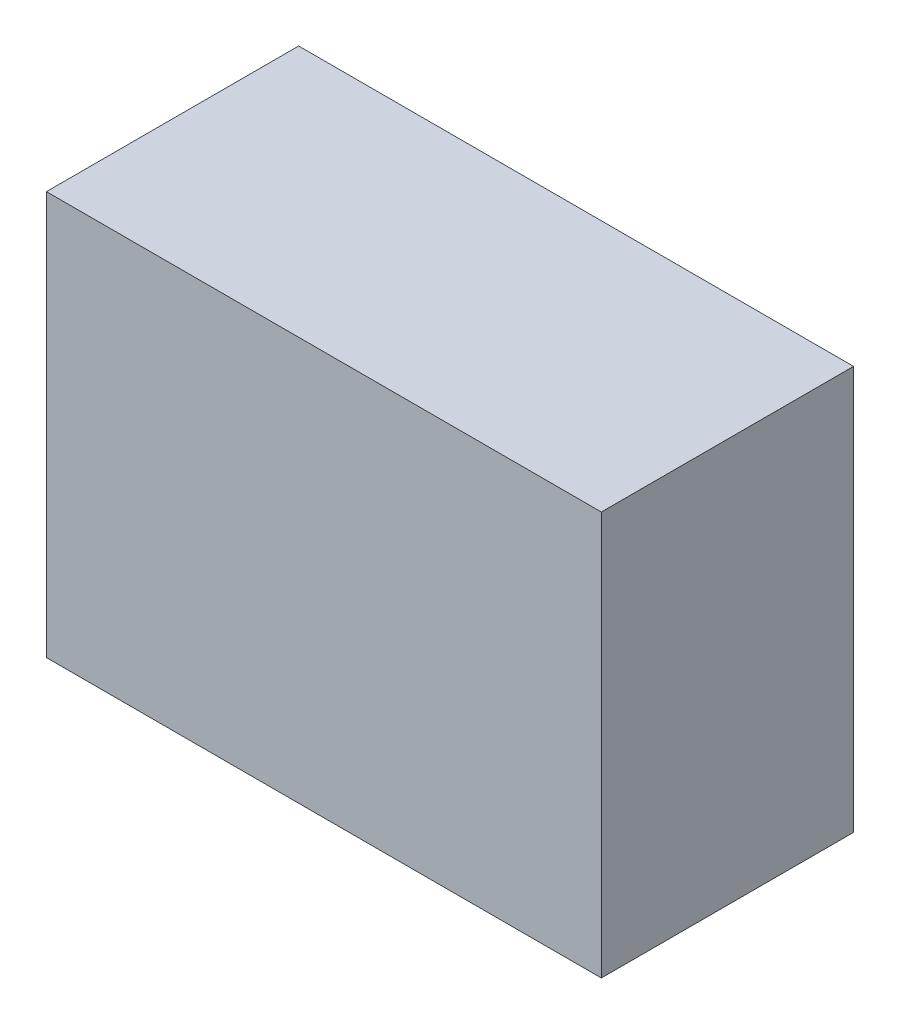
ISO-10303-21;
HEADER;
FILE_DESCRIPTION(('STEP AP214'),'2;1');
FILE_NAME('part.step','',(''),(''),'','','');
FILE_SCHEMA(('AUTOMOTIVE_DESIGN { 1 0 10303 214 1 1 1 1 }'));
ENDSEC;
DATA;
#1=APPLICATION_CONTEXT('core data for automotive mechanical design processes');
#2=APPLICATION_PROTOCOL_DEFINITION('international standard','automotive_design',2000,#1);
#3=PRODUCT_CONTEXT('',#1,'mechanical');
#4=PRODUCT('Part','Part','',(#3));
#5=PRODUCT_RELATED_PRODUCT_CATEGORY('part','',(#4));
#6=PRODUCT_DEFINITION_FORMATION('','',#4);
#7=PRODUCT_DEFINITION_CONTEXT('part definition',#1,'design');
#8=PRODUCT_DEFINITION('design','',#6,#7);
#9=PRODUCT_DEFINITION_SHAPE('','',#8);
#10=(LENGTH_UNIT() NAMED_UNIT(*) SI_UNIT(.MILLI.,.METRE.));
#11=(NAMED_UNIT(*) PLANE_ANGLE_UNIT() SI_UNIT($,.RADIAN.));
#12=(NAMED_UNIT(*) SI_UNIT($,.STERADIAN.) SOLID_ANGLE_UNIT());
#13=UNCERTAINTY_MEASURE_WITH_UNIT(LENGTH_MEASURE(1.E-05),#10,'distance_accuracy_value','');
#14=(GEOMETRIC_REPRESENTATION_CONTEXT(3) GLOBAL_UNCERTAINTY_ASSIGNED_CONTEXT((#13)) GLOBAL_UNIT_ASSIGNED_CONTEXT((#10,
#11,#12)) REPRESENTATION_CONTEXT('',''));
#15=CARTESIAN_POINT('',(0.,0.,0.));
#16=DIRECTION('',(0.,0.,1.));
#17=DIRECTION('',(1.,0.,0.));
#18=AXIS2_PLACEMENT_3D('',#15,#16,#17);
#19=CARTESIAN_POINT('',(0.5499989,-0.3999992,0.));
#20=DIRECTION('',(-1.,0.,0.));
#21=DIRECTION('',(0.,0.,1.));
#22=AXIS2_PLACEMENT_3D('',#19,#20,#21);
#23=PLANE('',#22);
#24=DIRECTION('',(0.,1.,0.));
#25=VECTOR('',#24,1.);
#26=CARTESIAN_POINT('',(0.5499989,-0.3999992,0.));
#27=LINE('',#26,#25);
#28=CARTESIAN_POINT('',(0.5499989,-0.3999992,0.));
#29=VERTEX_POINT('',#28);
#30=CARTESIAN_POINT('',(0.5499989,0.3999992,0.));
#31=VERTEX_POINT('',#30);
#32=EDGE_CURVE('E11',#29,#31,#27,.T.);
#33=ORIENTED_EDGE('',*,*,#32,.T.);
#34=DIRECTION('',(0.,0.,1.));
#35=VECTOR('',#34,1.);
#36=CARTESIAN_POINT('',(0.5499989,0.3999992,0.));
#37=LINE('',#36,#35);
#38=CARTESIAN_POINT('',(0.5499989,0.3999992,0.50000154));
#39=VERTEX_POINT('',#38);
#40=EDGE_CURVE('E28',#31,#39,#37,.T.);
#41=ORIENTED_EDGE('',*,*,#40,.T.);
#42=DIRECTION('',(0.,1.,0.));
#43=VECTOR('',#42,1.);
#44=CARTESIAN_POINT('',(0.5499989,-0.3999992,0.50000154));
#45=LINE('',#44,#43);
#46=CARTESIAN_POINT('',(0.5499989,-0.3999992,0.50000154));
#47=VERTEX_POINT('',#46);
#48=EDGE_CURVE('E65',#47,#39,#45,.T.);
#49=ORIENTED_EDGE('',*,*,#48,.F.);
#50=DIRECTION('',(0.,0.,1.));
#51=VECTOR('',#50,1.);
#52=CARTESIAN_POINT('',(0.5499989,-0.3999992,0.));
#53=LINE('',#52,#51);
#54=EDGE_CURVE('E67',#29,#47,#53,.T.);
#55=ORIENTED_EDGE('',*,*,#54,.F.);
#56=EDGE_LOOP('',(#33,#41,#49,#55));
#57=FACE_BOUND('',#56,.T.);
#58=ADVANCED_FACE('F17',(#57),#23,.F.);
#59=CARTESIAN_POINT('',(0.5499989,0.3999992,0.));
#60=DIRECTION('',(0.,-1.,0.));
#61=DIRECTION('',(0.,0.,-1.));
#62=AXIS2_PLACEMENT_3D('',#59,#60,#61);
#63=PLANE('',#62);
#64=DIRECTION('',(-1.,0.,0.));
#65=VECTOR('',#64,1.);
#66=CARTESIAN_POINT('',(0.5499989,0.3999992,0.));
#67=LINE('',#66,#65);
#68=CARTESIAN_POINT('',(-0.5499989,0.3999992,0.));
#69=VERTEX_POINT('',#68);
#70=EDGE_CURVE('E98',#31,#69,#67,.T.);
#71=ORIENTED_EDGE('',*,*,#70,.T.);
#72=DIRECTION('',(0.,0.,1.));
#73=VECTOR('',#72,1.);
#74=CARTESIAN_POINT('',(-0.5499989,0.3999992,0.));
#75=LINE('',#74,#73);
#76=CARTESIAN_POINT('',(-0.5499989,0.3999992,0.50000154));
#77=VERTEX_POINT('',#76);
#78=EDGE_CURVE('E97',#69,#77,#75,.T.);
#79=ORIENTED_EDGE('',*,*,#78,.T.);
#80=DIRECTION('',(-1.,0.,0.));
#81=VECTOR('',#80,1.);
#82=CARTESIAN_POINT('',(0.5499989,0.3999992,0.50000154));
#83=LINE('',#82,#81);
#84=EDGE_CURVE('E72',#39,#77,#83,.T.);
#85=ORIENTED_EDGE('',*,*,#84,.F.);
#86=ORIENTED_EDGE('',*,*,#40,.F.);
#87=EDGE_LOOP('',(#71,#79,#85,#86));
#88=FACE_BOUND('',#87,.T.);
#89=ADVANCED_FACE('F178',(#88),#63,.F.);
#90=CARTESIAN_POINT('',(-0.5499989,0.3999992,0.));
#91=DIRECTION('',(1.,0.,0.));
#92=DIRECTION('',(0.,1.,0.));
#93=AXIS2_PLACEMENT_3D('',#90,#91,#92);
#94=PLANE('',#93);
#95=DIRECTION('',(0.,-1.,0.));
#96=VECTOR('',#95,1.);
#97=CARTESIAN_POINT('',(-0.5499989,0.3999992,0.));
#98=LINE('',#97,#96);
#99=CARTESIAN_POINT('',(-0.5499989,-0.3999992,0.));
#100=VERTEX_POINT('',#99);
#101=EDGE_CURVE('E93',#69,#100,#98,.T.);
#102=ORIENTED_EDGE('',*,*,#101,.T.);
#103=DIRECTION('',(0.,0.,1.));
#104=VECTOR('',#103,1.);
#105=CARTESIAN_POINT('',(-0.5499989,-0.3999992,0.));
#106=LINE('',#105,#104);
#107=CARTESIAN_POINT('',(-0.5499989,-0.3999992,0.50000154));
#108=VERTEX_POINT('',#107);
#109=EDGE_CURVE('E21',#100,#108,#106,.T.);
#110=ORIENTED_EDGE('',*,*,#109,.T.);
#111=DIRECTION('',(0.,-1.,0.));
#112=VECTOR('',#111,1.);
#113=CARTESIAN_POINT('',(-0.5499989,0.3999992,0.50000154));
#114=LINE('',#113,#112);
#115=EDGE_CURVE('E85',#77,#108,#114,.T.);
#116=ORIENTED_EDGE('',*,*,#115,.F.);
#117=ORIENTED_EDGE('',*,*,#78,.F.);
#118=EDGE_LOOP('',(#102,#110,#116,#117));
#119=FACE_BOUND('',#118,.T.);
#120=ADVANCED_FACE('F118',(#119),#94,.F.);
#121=CARTESIAN_POINT('',(-0.5499989,-0.3999992,0.));
#122=DIRECTION('',(0.,1.,0.));
#123=DIRECTION('',(1.,0.,0.));
#124=AXIS2_PLACEMENT_3D('',#121,#122,#123);
#125=PLANE('',#124);
#126=DIRECTION('',(1.,0.,0.));
#127=VECTOR('',#126,1.);
#128=CARTESIAN_POINT('',(-0.5499989,-0.3999992,0.));
#129=LINE('',#128,#127);
#130=EDGE_CURVE('E80',#100,#29,#129,.T.);
#131=ORIENTED_EDGE('',*,*,#130,.T.);
#132=ORIENTED_EDGE('',*,*,#54,.T.);
#133=DIRECTION('',(1.,0.,0.));
#134=VECTOR('',#133,1.);
#135=CARTESIAN_POINT('',(-0.5499989,-0.3999992,0.50000154));
#136=LINE('',#135,#134);
#137=EDGE_CURVE('E78',#108,#47,#136,.T.);
#138=ORIENTED_EDGE('',*,*,#137,.F.);
#139=ORIENTED_EDGE('',*,*,#109,.F.);
#140=EDGE_LOOP('',(#131,#132,#138,#139));
#141=FACE_BOUND('',#140,.T.);
#142=ADVANCED_FACE('F76',(#141),#125,.F.);
#143=CARTESIAN_POINT('',(0.5499989,-0.3999992,0.));
#144=DIRECTION('',(0.,0.,-1.));
#145=DIRECTION('',(0.,-1.,0.));
#146=AXIS2_PLACEMENT_3D('',#143,#144,#145);
#147=PLANE('',#146);
#148=ORIENTED_EDGE('',*,*,#130,.F.);
#149=ORIENTED_EDGE('',*,*,#101,.F.);
#150=ORIENTED_EDGE('',*,*,#70,.F.);
#151=ORIENTED_EDGE('',*,*,#32,.F.);
#152=EDGE_LOOP('',(#148,#149,#150,#151));
#153=FACE_BOUND('',#152,.T.);
#154=ADVANCED_FACE('F19',(#153),#147,.T.);
#155=CARTESIAN_POINT('',(0.5499989,-0.3999992,0.50000154));
#156=DIRECTION('',(0.,0.,-1.));
#157=DIRECTION('',(0.,-1.,0.));
#158=AXIS2_PLACEMENT_3D('',#155,#156,#157);
#159=PLANE('',#158);
#160=ORIENTED_EDGE('',*,*,#48,.T.);
#161=ORIENTED_EDGE('',*,*,#84,.T.);
#162=ORIENTED_EDGE('',*,*,#115,.T.);
#163=ORIENTED_EDGE('',*,*,#137,.T.);
#164=EDGE_LOOP('',(#160,#161,#162,#163));
#165=FACE_BOUND('',#164,.T.);
#166=ADVANCED_FACE('F83',(#165),#159,.F.);
#167=CLOSED_SHELL('',(#58,#89,#120,#142,#154,#166));
#168=MANIFOLD_SOLID_BREP('B1',#167);
#169=ADVANCED_BREP_SHAPE_REPRESENTATION('',(#18,#168),#14);
#170=SHAPE_DEFINITION_REPRESENTATION(#9,#169);
ENDSEC;
END-ISO-10303-21;
